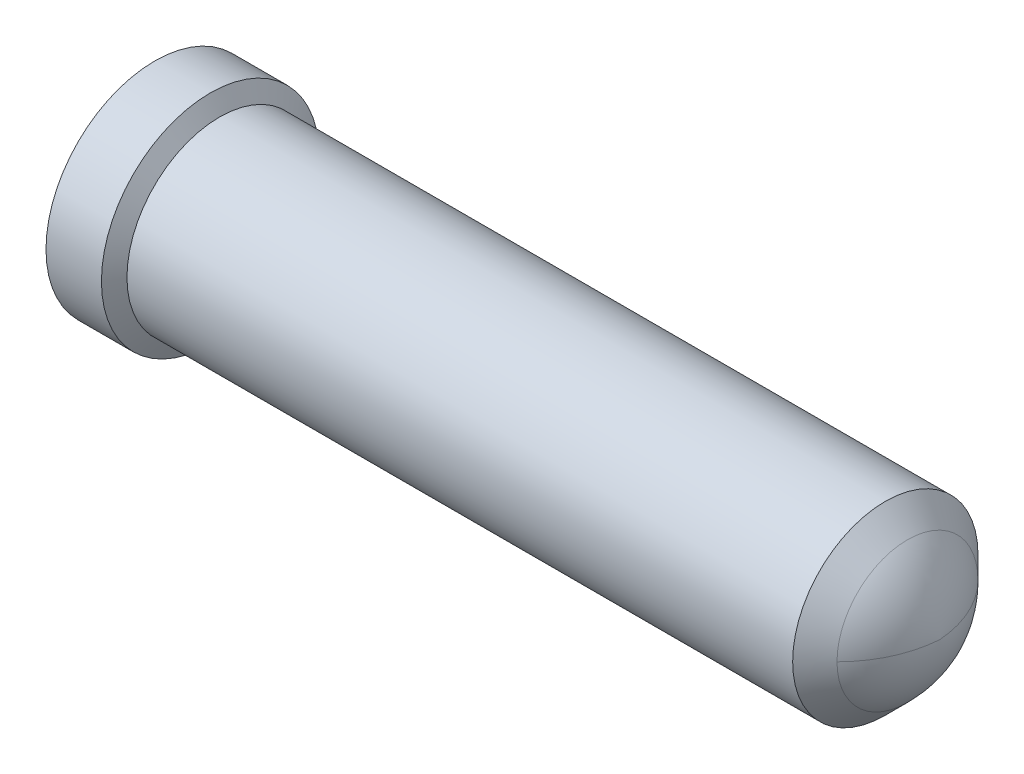
ISO-10303-21;
HEADER;
FILE_DESCRIPTION(('STEP AP214'),'2;1');
FILE_NAME('part.step','',(''),(''),'','','');
FILE_SCHEMA(('AUTOMOTIVE_DESIGN { 1 0 10303 214 1 1 1 1 }'));
ENDSEC;
DATA;
#1=APPLICATION_CONTEXT('core data for automotive mechanical design processes');
#2=APPLICATION_PROTOCOL_DEFINITION('international standard','automotive_design',2000,#1);
#3=PRODUCT_CONTEXT('',#1,'mechanical');
#4=PRODUCT('Part','Part','',(#3));
#5=PRODUCT_RELATED_PRODUCT_CATEGORY('part','',(#4));
#6=PRODUCT_DEFINITION_FORMATION('','',#4);
#7=PRODUCT_DEFINITION_CONTEXT('part definition',#1,'design');
#8=PRODUCT_DEFINITION('design','',#6,#7);
#9=PRODUCT_DEFINITION_SHAPE('','',#8);
#10=(LENGTH_UNIT() NAMED_UNIT(*) SI_UNIT(.MILLI.,.METRE.));
#11=(NAMED_UNIT(*) PLANE_ANGLE_UNIT() SI_UNIT($,.RADIAN.));
#12=(NAMED_UNIT(*) SI_UNIT($,.STERADIAN.) SOLID_ANGLE_UNIT());
#13=UNCERTAINTY_MEASURE_WITH_UNIT(LENGTH_MEASURE(1.E-05),#10,'distance_accuracy_value','');
#14=(GEOMETRIC_REPRESENTATION_CONTEXT(3) GLOBAL_UNCERTAINTY_ASSIGNED_CONTEXT((#13)) GLOBAL_UNIT_ASSIGNED_CONTEXT((#10,
#11,#12)) REPRESENTATION_CONTEXT('',''));
#15=CARTESIAN_POINT('',(0.,0.,0.));
#16=DIRECTION('',(0.,0.,1.));
#17=DIRECTION('',(1.,0.,0.));
#18=AXIS2_PLACEMENT_3D('',#15,#16,#17);
#19=CARTESIAN_POINT('',(4.3114201808,0.,-0.40386));
#20=CARTESIAN_POINT('',(4.3114201808,-0.80772,-0.40386));
#21=CARTESIAN_POINT('',(4.3114201808,-0.80772,0.40386));
#22=CARTESIAN_POINT('',(4.3114201808,0.,0.40386));
#23=CARTESIAN_POINT('',(4.4206566654,0.,-0.2946235154));
#24=CARTESIAN_POINT('',(4.4206566654,-0.5892470054,-0.2946235154));
#25=CARTESIAN_POINT('',(4.4206566654,-0.5892470054,0.2946235154));
#26=CARTESIAN_POINT('',(4.4206566654,0.,0.2946235154));
#27=CARTESIAN_POINT('',(4.4848151604,0.,-0.1540926814));
#28=CARTESIAN_POINT('',(4.4848151604,-0.3081853628,-0.1540926814));
#29=CARTESIAN_POINT('',(4.4848151604,-0.3081853628,0.1540926814));
#30=CARTESIAN_POINT('',(4.4848151604,0.,0.1540926814));
#31=CARTESIAN_POINT('',(4.4958,0.,0.));
#32=CARTESIAN_POINT('',(4.4958,0.,0.));
#33=CARTESIAN_POINT('',(4.4958,0.,0.));
#34=CARTESIAN_POINT('',(4.4958,0.,0.));
#35=(BOUNDED_SURFACE() B_SPLINE_SURFACE(3,3,((#19,#20,#21,#22),(#23,#24,#25,#26),(#27,#28,#29,
#30),(#31,#32,#33,#34)),.UNSPECIFIED.,.F.,.F.,.F.) B_SPLINE_SURFACE_WITH_KNOTS((4,4),(4,4),(0.,
1.),(0.,1.),.UNSPECIFIED.) GEOMETRIC_REPRESENTATION_ITEM() RATIONAL_B_SPLINE_SURFACE(((1.,
0.333333333333333,0.333333333333333,1.),(0.957939338108256,0.319313112702752,0.319313112702752,
0.957939338108256),(0.957939338108256,0.319313112702752,0.319313112702752,0.957939338108256),
(1.,0.333333333333333,0.333333333333333,1.))) REPRESENTATION_ITEM('') SURFACE());
#36=CARTESIAN_POINT('',(4.3114201808,0.,0.40386));
#37=CARTESIAN_POINT('',(4.4206566654,0.,0.2946235154));
#38=CARTESIAN_POINT('',(4.4848151604,0.,0.1540926814));
#39=CARTESIAN_POINT('',(4.4958,0.,0.));
#40=(BOUNDED_CURVE() B_SPLINE_CURVE(3,(#36,#37,#38,#39),.UNSPECIFIED.,.F.,
.F.) B_SPLINE_CURVE_WITH_KNOTS((4,4),(0.,1.),
.UNSPECIFIED.) CURVE() GEOMETRIC_REPRESENTATION_ITEM() RATIONAL_B_SPLINE_CURVE((1.,
0.957939338108256,0.957939338108256,1.)) REPRESENTATION_ITEM(''));
#41=CARTESIAN_POINT('',(4.3114201808,-1.81320273886141E-11,0.403860000000002));
#42=VERTEX_POINT('',#41);
#43=CARTESIAN_POINT('',(4.4958,0.,0.));
#44=VERTEX_POINT('',#43);
#45=EDGE_CURVE('E39',#42,#44,#40,.T.);
#46=CARTESIAN_POINT('',(4.3114201808,0.,0.));
#47=DIRECTION('',(-1.,0.,0.));
#48=DIRECTION('',(0.,0.,1.));
#49=AXIS2_PLACEMENT_3D('',#46,#47,#48);
#50=CIRCLE('',#49,0.40386);
#51=CARTESIAN_POINT('',(4.3114201808,-1.24249605960303E-10,-0.403860000000002));
#52=VERTEX_POINT('',#51);
#53=EDGE_CURVE('E45',#42,#52,#50,.F.);
#54=CARTESIAN_POINT('',(4.3114201808,0.,-0.40386));
#55=CARTESIAN_POINT('',(4.4206566654,0.,-0.2946235154));
#56=CARTESIAN_POINT('',(4.4848151604,0.,-0.1540926814));
#57=CARTESIAN_POINT('',(4.4958,0.,0.));
#58=(BOUNDED_CURVE() B_SPLINE_CURVE(3,(#54,#55,#56,#57),.UNSPECIFIED.,.F.,
.F.) B_SPLINE_CURVE_WITH_KNOTS((4,4),(0.,1.),
.UNSPECIFIED.) CURVE() GEOMETRIC_REPRESENTATION_ITEM() RATIONAL_B_SPLINE_CURVE((1.,
0.957939338108256,0.957939338108256,1.)) REPRESENTATION_ITEM(''));
#59=EDGE_CURVE('E50',#44,#52,#58,.F.);
#60=ORIENTED_EDGE('',*,*,#45,.F.);
#61=ORIENTED_EDGE('',*,*,#53,.T.);
#62=ORIENTED_EDGE('',*,*,#59,.F.);
#63=EDGE_LOOP('',(#60,#61,#62));
#64=FACE_BOUND('',#63,.T.);
#65=ADVANCED_FACE('F17',(#64),#35,.T.);
#66=CARTESIAN_POINT('',(4.3114201808,0.,0.40386));
#67=CARTESIAN_POINT('',(4.3114201808,0.80772,0.40386));
#68=CARTESIAN_POINT('',(4.3114201808,0.80772,-0.40386));
#69=CARTESIAN_POINT('',(4.3114201808,0.,-0.40386));
#70=CARTESIAN_POINT('',(4.4206566654,0.,0.2946235154));
#71=CARTESIAN_POINT('',(4.4206566654,0.5892470054,0.2946235154));
#72=CARTESIAN_POINT('',(4.4206566654,0.5892470054,-0.2946235154));
#73=CARTESIAN_POINT('',(4.4206566654,0.,-0.2946235154));
#74=CARTESIAN_POINT('',(4.4848151604,0.,0.1540926814));
#75=CARTESIAN_POINT('',(4.4848151604,0.3081853628,0.1540926814));
#76=CARTESIAN_POINT('',(4.4848151604,0.3081853628,-0.1540926814));
#77=CARTESIAN_POINT('',(4.4848151604,0.,-0.1540926814));
#78=CARTESIAN_POINT('',(4.4958,0.,0.));
#79=CARTESIAN_POINT('',(4.4958,0.,0.));
#80=CARTESIAN_POINT('',(4.4958,0.,0.));
#81=CARTESIAN_POINT('',(4.4958,0.,0.));
#82=(BOUNDED_SURFACE() B_SPLINE_SURFACE(3,3,((#66,#67,#68,#69),(#70,#71,#72,#73),(#74,#75,#76,
#77),(#78,#79,#80,#81)),.UNSPECIFIED.,.F.,.F.,.F.) B_SPLINE_SURFACE_WITH_KNOTS((4,4),(4,4),(0.,
1.),(0.,1.),.UNSPECIFIED.) GEOMETRIC_REPRESENTATION_ITEM() RATIONAL_B_SPLINE_SURFACE(((1.,
0.333333333333333,0.333333333333333,1.),(0.957939338108256,0.319313112702752,0.319313112702752,
0.957939338108256),(0.957939338108256,0.319313112702752,0.319313112702752,0.957939338108256),
(1.,0.333333333333333,0.333333333333333,1.))) REPRESENTATION_ITEM('') SURFACE());
#83=CARTESIAN_POINT('',(4.3114201808,0.,0.));
#84=DIRECTION('',(-1.,0.,0.));
#85=DIRECTION('',(0.,0.,1.));
#86=AXIS2_PLACEMENT_3D('',#83,#84,#85);
#87=CIRCLE('',#86,0.40386);
#88=EDGE_CURVE('E47',#52,#42,#87,.F.);
#89=ORIENTED_EDGE('',*,*,#59,.T.);
#90=ORIENTED_EDGE('',*,*,#88,.T.);
#91=ORIENTED_EDGE('',*,*,#45,.T.);
#92=EDGE_LOOP('',(#89,#90,#91));
#93=FACE_BOUND('',#92,.T.);
#94=ADVANCED_FACE('F52',(#93),#82,.T.);
#95=CARTESIAN_POINT('',(4.3114201808,0.,0.));
#96=DIRECTION('',(-1.,0.,0.));
#97=DIRECTION('',(0.,0.,1.));
#98=AXIS2_PLACEMENT_3D('',#95,#96,#97);
#99=CONICAL_SURFACE('',#98,0.40386,0.78539816339745);
#100=CARTESIAN_POINT('',(4.1844201808,0.,0.));
#101=DIRECTION('',(-1.,0.,0.));
#102=DIRECTION('',(0.,0.,1.));
#103=AXIS2_PLACEMENT_3D('',#100,#101,#102);
#104=CIRCLE('',#103,0.53086);
#105=CARTESIAN_POINT('',(4.1844201808,0.,0.53086));
#106=VERTEX_POINT('',#105);
#107=EDGE_CURVE('E53',#106,#106,#104,.F.);
#108=ORIENTED_EDGE('',*,*,#107,.T.);
#109=EDGE_LOOP('',(#108));
#110=FACE_BOUND('',#109,.T.);
#111=ORIENTED_EDGE('',*,*,#88,.F.);
#112=ORIENTED_EDGE('',*,*,#53,.F.);
#113=EDGE_LOOP('',(#111,#112));
#114=FACE_BOUND('',#113,.T.);
#115=ADVANCED_FACE('F46',(#110,#114),#99,.T.);
#116=CARTESIAN_POINT('',(4.1844201808,0.,0.));
#117=DIRECTION('',(-1.,0.,0.));
#118=DIRECTION('',(0.,0.,1.));
#119=AXIS2_PLACEMENT_3D('',#116,#117,#118);
#120=CYLINDRICAL_SURFACE('',#119,0.53086);
#121=CARTESIAN_POINT('',(0.371026131199992,0.,0.));
#122=DIRECTION('',(-1.,0.,0.));
#123=DIRECTION('',(0.,0.,1.));
#124=AXIS2_PLACEMENT_3D('',#121,#122,#123);
#125=CIRCLE('',#124,0.53086);
#126=CARTESIAN_POINT('',(0.3710261312,0.,0.53086));
#127=VERTEX_POINT('',#126);
#128=EDGE_CURVE('E56',#127,#127,#125,.F.);
#129=ORIENTED_EDGE('',*,*,#128,.T.);
#130=EDGE_LOOP('',(#129));
#131=FACE_BOUND('',#130,.T.);
#132=ORIENTED_EDGE('',*,*,#107,.F.);
#133=EDGE_LOOP('',(#132));
#134=FACE_BOUND('',#133,.T.);
#135=ADVANCED_FACE('F121',(#131,#134),#120,.T.);
#136=CARTESIAN_POINT('',(0.3710261312,0.,0.));
#137=DIRECTION('',(-1.,0.,0.));
#138=DIRECTION('',(0.,0.,1.));
#139=AXIS2_PLACEMENT_3D('',#136,#137,#138);
#140=CONICAL_SURFACE('',#139,0.53086,1.0471976503491);
#141=CARTESIAN_POINT('',(0.3175,0.,0.));
#142=DIRECTION('',(-1.,0.,0.));
#143=DIRECTION('',(0.,0.,1.));
#144=AXIS2_PLACEMENT_3D('',#141,#142,#143);
#145=CIRCLE('',#144,0.62357);
#146=CARTESIAN_POINT('',(0.3175,0.,0.62357));
#147=VERTEX_POINT('',#146);
#148=EDGE_CURVE('E80',#147,#147,#145,.F.);
#149=ORIENTED_EDGE('',*,*,#148,.T.);
#150=EDGE_LOOP('',(#149));
#151=FACE_BOUND('',#150,.T.);
#152=ORIENTED_EDGE('',*,*,#128,.F.);
#153=EDGE_LOOP('',(#152));
#154=FACE_BOUND('',#153,.T.);
#155=ADVANCED_FACE('F118',(#151,#154),#140,.T.);
#156=CARTESIAN_POINT('',(2.2051134714,0.,0.));
#157=DIRECTION('',(-1.,0.,0.));
#158=DIRECTION('',(0.,0.,1.));
#159=AXIS2_PLACEMENT_3D('',#156,#157,#158);
#160=CONICAL_SURFACE('',#159,0.,1.02974426449315);
#161=CARTESIAN_POINT('',(2.2051134714,0.,0.));
#162=VERTEX_POINT('',#161);
#163=VERTEX_LOOP('',#162);
#164=FACE_BOUND('',#163,.T.);
#165=CARTESIAN_POINT('',(1.9304,0.,0.));
#166=DIRECTION('',(-1.,0.,0.));
#167=DIRECTION('',(0.,0.,1.));
#168=AXIS2_PLACEMENT_3D('',#165,#166,#167);
#169=CIRCLE('',#168,0.4572);
#170=CARTESIAN_POINT('',(1.9304,0.,0.4572));
#171=VERTEX_POINT('',#170);
#172=EDGE_CURVE('E83',#171,#171,#169,.F.);
#173=ORIENTED_EDGE('',*,*,#172,.F.);
#174=EDGE_LOOP('',(#173));
#175=FACE_BOUND('',#174,.T.);
#176=ADVANCED_FACE('F112',(#164,#175),#160,.F.);
#177=CARTESIAN_POINT('',(0.3175,0.,0.));
#178=DIRECTION('',(-1.,0.,0.));
#179=DIRECTION('',(0.,0.,1.));
#180=AXIS2_PLACEMENT_3D('',#177,#178,#179);
#181=CYLINDRICAL_SURFACE('',#180,0.62357);
#182=CARTESIAN_POINT('',(0.,0.,0.));
#183=DIRECTION('',(-1.,0.,0.));
#184=DIRECTION('',(0.,0.,1.));
#185=AXIS2_PLACEMENT_3D('',#182,#183,#184);
#186=CIRCLE('',#185,0.62357);
#187=CARTESIAN_POINT('',(0.,0.,0.62357));
#188=VERTEX_POINT('',#187);
#189=EDGE_CURVE('E21',#188,#188,#186,.F.);
#190=ORIENTED_EDGE('',*,*,#189,.T.);
#191=EDGE_LOOP('',(#190));
#192=FACE_BOUND('',#191,.T.);
#193=ORIENTED_EDGE('',*,*,#148,.F.);
#194=EDGE_LOOP('',(#193));
#195=FACE_BOUND('',#194,.T.);
#196=ADVANCED_FACE('F92',(#192,#195),#181,.T.);
#197=CARTESIAN_POINT('',(1.9304,0.,0.));
#198=DIRECTION('',(-1.,0.,0.));
#199=DIRECTION('',(0.,0.,1.));
#200=AXIS2_PLACEMENT_3D('',#197,#198,#199);
#201=CYLINDRICAL_SURFACE('',#200,0.4572);
#202=CARTESIAN_POINT('',(0.0888999999999474,0.,0.));
#203=DIRECTION('',(-1.,0.,0.));
#204=DIRECTION('',(1.15220194784863E-13,0.,1.));
#205=AXIS2_PLACEMENT_3D('',#202,#203,#204);
#206=CIRCLE('',#205,0.4572);
#207=CARTESIAN_POINT('',(0.0889,0.,0.4572));
#208=VERTEX_POINT('',#207);
#209=EDGE_CURVE('E27',#208,#208,#206,.F.);
#210=ORIENTED_EDGE('',*,*,#209,.F.);
#211=EDGE_LOOP('',(#210));
#212=FACE_BOUND('',#211,.T.);
#213=ORIENTED_EDGE('',*,*,#172,.T.);
#214=EDGE_LOOP('',(#213));
#215=FACE_BOUND('',#214,.T.);
#216=ADVANCED_FACE('F97',(#212,#215),#201,.F.);
#217=CARTESIAN_POINT('',(0.,-0.63105284,0.63105284));
#218=DIRECTION('',(1.,0.,0.));
#219=DIRECTION('',(0.,0.,-1.));
#220=AXIS2_PLACEMENT_3D('',#217,#218,#219);
#221=PLANE('',#220);
#222=CARTESIAN_POINT('',(0.,0.,0.));
#223=DIRECTION('',(-1.,0.,0.));
#224=DIRECTION('',(0.,0.,1.));
#225=AXIS2_PLACEMENT_3D('',#222,#223,#224);
#226=CIRCLE('',#225,0.5461);
#227=CARTESIAN_POINT('',(0.,0.,0.5461));
#228=VERTEX_POINT('',#227);
#229=EDGE_CURVE('E11',#228,#228,#226,.T.);
#230=ORIENTED_EDGE('',*,*,#229,.F.);
#231=EDGE_LOOP('',(#230));
#232=FACE_BOUND('',#231,.T.);
#233=ORIENTED_EDGE('',*,*,#189,.F.);
#234=EDGE_LOOP('',(#233));
#235=FACE_BOUND('',#234,.T.);
#236=ADVANCED_FACE('F19',(#232,#235),#221,.F.);
#237=CARTESIAN_POINT('',(0.0889,0.,0.));
#238=DIRECTION('',(-1.,0.,0.));
#239=DIRECTION('',(0.,0.,1.));
#240=AXIS2_PLACEMENT_3D('',#237,#238,#239);
#241=CONICAL_SURFACE('',#240,0.4572,0.785398163397449);
#242=ORIENTED_EDGE('',*,*,#229,.T.);
#243=EDGE_LOOP('',(#242));
#244=FACE_BOUND('',#243,.T.);
#245=ORIENTED_EDGE('',*,*,#209,.T.);
#246=EDGE_LOOP('',(#245));
#247=FACE_BOUND('',#246,.T.);
#248=ADVANCED_FACE('F96',(#244,#247),#241,.F.);
#249=CLOSED_SHELL('',(#65,#94,#115,#135,#155,#176,#196,#216,#236,#248));
#250=MANIFOLD_SOLID_BREP('B1',#249);
#251=ADVANCED_BREP_SHAPE_REPRESENTATION('',(#18,#250),#14);
#252=SHAPE_DEFINITION_REPRESENTATION(#9,#251);
ENDSEC;
END-ISO-10303-21;
